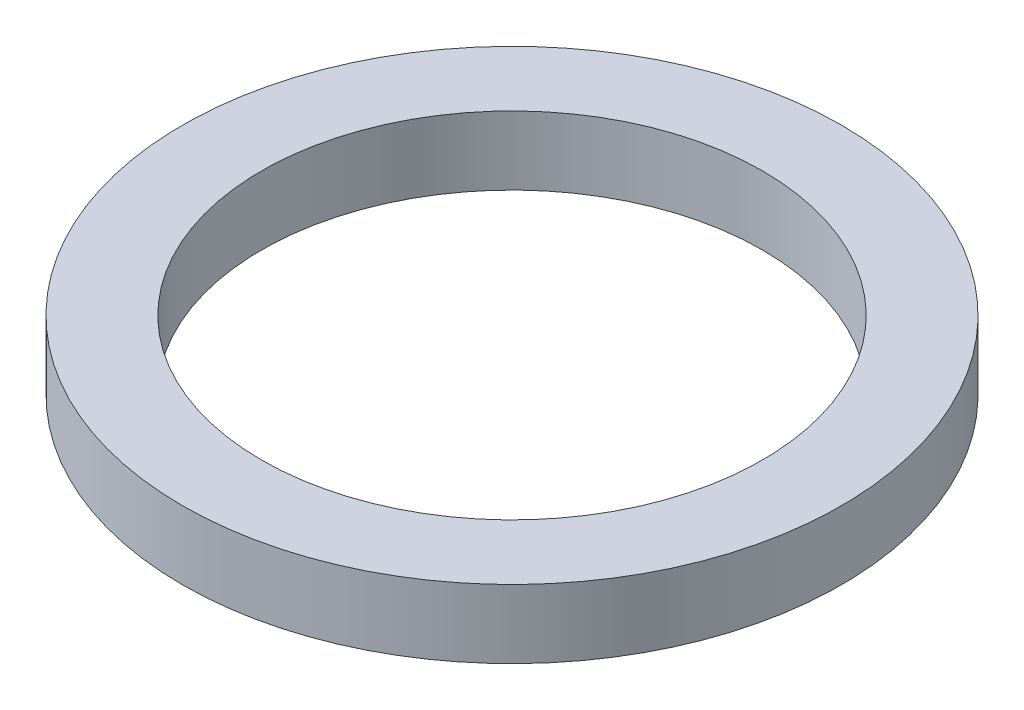
ISO-10303-21;
HEADER;
FILE_DESCRIPTION(('STEP AP214'),'2;1');
FILE_NAME('part.step','',(''),(''),'','','');
FILE_SCHEMA(('AUTOMOTIVE_DESIGN { 1 0 10303 214 1 1 1 1 }'));
ENDSEC;
DATA;
#1=APPLICATION_CONTEXT('core data for automotive mechanical design processes');
#2=APPLICATION_PROTOCOL_DEFINITION('international standard','automotive_design',2000,#1);
#3=PRODUCT_CONTEXT('',#1,'mechanical');
#4=PRODUCT('Part','Part','',(#3));
#5=PRODUCT_RELATED_PRODUCT_CATEGORY('part','',(#4));
#6=PRODUCT_DEFINITION_FORMATION('','',#4);
#7=PRODUCT_DEFINITION_CONTEXT('part definition',#1,'design');
#8=PRODUCT_DEFINITION('design','',#6,#7);
#9=PRODUCT_DEFINITION_SHAPE('','',#8);
#10=(LENGTH_UNIT() NAMED_UNIT(*) SI_UNIT(.MILLI.,.METRE.));
#11=(NAMED_UNIT(*) PLANE_ANGLE_UNIT() SI_UNIT($,.RADIAN.));
#12=(NAMED_UNIT(*) SI_UNIT($,.STERADIAN.) SOLID_ANGLE_UNIT());
#13=UNCERTAINTY_MEASURE_WITH_UNIT(LENGTH_MEASURE(1.E-05),#10,'distance_accuracy_value','');
#14=(GEOMETRIC_REPRESENTATION_CONTEXT(3) GLOBAL_UNCERTAINTY_ASSIGNED_CONTEXT((#13)) GLOBAL_UNIT_ASSIGNED_CONTEXT((#10,
#11,#12)) REPRESENTATION_CONTEXT('',''));
#15=CARTESIAN_POINT('',(0.,0.,0.));
#16=DIRECTION('',(0.,0.,1.));
#17=DIRECTION('',(1.,0.,0.));
#18=AXIS2_PLACEMENT_3D('',#15,#16,#17);
#19=CARTESIAN_POINT('',(0.,13.,0.));
#20=DIRECTION('',(0.,-1.,0.));
#21=DIRECTION('',(0.,0.,-1.));
#22=AXIS2_PLACEMENT_3D('',#19,#20,#21);
#23=CYLINDRICAL_SURFACE('',#22,62.5);
#24=CARTESIAN_POINT('',(0.,13.,0.));
#25=DIRECTION('',(0.,1.,0.));
#26=DIRECTION('',(0.,0.,1.));
#27=AXIS2_PLACEMENT_3D('',#24,#25,#26);
#28=CIRCLE('',#27,62.5);
#29=CARTESIAN_POINT('',(0.,13.,-62.5));
#30=VERTEX_POINT('',#29);
#31=EDGE_CURVE('E10',#30,#30,#28,.T.);
#32=CARTESIAN_POINT('',(0.,0.,0.));
#33=DIRECTION('',(0.,1.,0.));
#34=DIRECTION('',(0.,0.,1.));
#35=AXIS2_PLACEMENT_3D('',#32,#33,#34);
#36=CIRCLE('',#35,62.5);
#37=CARTESIAN_POINT('',(0.,0.,-62.5));
#38=VERTEX_POINT('',#37);
#39=EDGE_CURVE('E37',#38,#38,#36,.T.);
#40=CARTESIAN_POINT('',(0.,13.,-62.5));
#41=CARTESIAN_POINT('',(0.,12.8645833333333,-62.5));
#42=CARTESIAN_POINT('',(0.,12.7291666666667,-62.5));
#43=CARTESIAN_POINT('',(0.,12.4583333333333,-62.5));
#44=CARTESIAN_POINT('',(0.,12.3229166666667,-62.5));
#45=CARTESIAN_POINT('',(0.,12.0520833333333,-62.5));
#46=CARTESIAN_POINT('',(0.,11.9166666666667,-62.5));
#47=CARTESIAN_POINT('',(0.,11.6458333333333,-62.5));
#48=CARTESIAN_POINT('',(0.,11.5104166666667,-62.5));
#49=CARTESIAN_POINT('',(0.,11.2395833333333,-62.5));
#50=CARTESIAN_POINT('',(0.,11.1041666666667,-62.5));
#51=CARTESIAN_POINT('',(0.,10.8333333333333,-62.5));
#52=CARTESIAN_POINT('',(0.,10.6979166666667,-62.5));
#53=CARTESIAN_POINT('',(0.,10.4270833333333,-62.5));
#54=CARTESIAN_POINT('',(0.,10.2916666666667,-62.5));
#55=CARTESIAN_POINT('',(0.,10.0208333333333,-62.5));
#56=CARTESIAN_POINT('',(0.,9.88541666666667,-62.5));
#57=CARTESIAN_POINT('',(0.,9.61458333333333,-62.5));
#58=CARTESIAN_POINT('',(0.,9.47916666666667,-62.5));
#59=CARTESIAN_POINT('',(0.,9.20833333333333,-62.5));
#60=CARTESIAN_POINT('',(0.,9.07291666666667,-62.5));
#61=CARTESIAN_POINT('',(0.,8.80208333333333,-62.5));
#62=CARTESIAN_POINT('',(0.,8.66666666666667,-62.5));
#63=CARTESIAN_POINT('',(0.,8.39583333333333,-62.5));
#64=CARTESIAN_POINT('',(0.,8.26041666666667,-62.5));
#65=CARTESIAN_POINT('',(0.,7.98958333333333,-62.5));
#66=CARTESIAN_POINT('',(0.,7.85416666666667,-62.5));
#67=CARTESIAN_POINT('',(0.,7.58333333333333,-62.5));
#68=CARTESIAN_POINT('',(0.,7.44791666666667,-62.5));
#69=CARTESIAN_POINT('',(0.,7.17708333333333,-62.5));
#70=CARTESIAN_POINT('',(0.,7.04166666666667,-62.5));
#71=CARTESIAN_POINT('',(0.,6.77083333333333,-62.5));
#72=CARTESIAN_POINT('',(0.,6.63541666666667,-62.5));
#73=CARTESIAN_POINT('',(0.,6.36458333333333,-62.5));
#74=CARTESIAN_POINT('',(0.,6.22916666666667,-62.5));
#75=CARTESIAN_POINT('',(0.,5.95833333333333,-62.5));
#76=CARTESIAN_POINT('',(0.,5.82291666666667,-62.5));
#77=CARTESIAN_POINT('',(0.,5.55208333333333,-62.5));
#78=CARTESIAN_POINT('',(0.,5.41666666666667,-62.5));
#79=CARTESIAN_POINT('',(0.,5.14583333333333,-62.5));
#80=CARTESIAN_POINT('',(0.,5.01041666666667,-62.5));
#81=CARTESIAN_POINT('',(0.,4.73958333333333,-62.5));
#82=CARTESIAN_POINT('',(0.,4.60416666666667,-62.5));
#83=CARTESIAN_POINT('',(0.,4.33333333333333,-62.5));
#84=CARTESIAN_POINT('',(0.,4.19791666666667,-62.5));
#85=CARTESIAN_POINT('',(0.,3.92708333333333,-62.5));
#86=CARTESIAN_POINT('',(0.,3.79166666666667,-62.5));
#87=CARTESIAN_POINT('',(0.,3.52083333333333,-62.5));
#88=CARTESIAN_POINT('',(0.,3.38541666666667,-62.5));
#89=CARTESIAN_POINT('',(0.,3.11458333333333,-62.5));
#90=CARTESIAN_POINT('',(0.,2.97916666666667,-62.5));
#91=CARTESIAN_POINT('',(0.,2.70833333333333,-62.5));
#92=CARTESIAN_POINT('',(0.,2.57291666666667,-62.5));
#93=CARTESIAN_POINT('',(0.,2.30208333333333,-62.5));
#94=CARTESIAN_POINT('',(0.,2.16666666666667,-62.5));
#95=CARTESIAN_POINT('',(0.,1.89583333333333,-62.5));
#96=CARTESIAN_POINT('',(0.,1.76041666666667,-62.5));
#97=CARTESIAN_POINT('',(0.,1.48958333333333,-62.5));
#98=CARTESIAN_POINT('',(0.,1.35416666666667,-62.5));
#99=CARTESIAN_POINT('',(0.,1.08333333333333,-62.5));
#100=CARTESIAN_POINT('',(0.,0.947916666666667,-62.5));
#101=CARTESIAN_POINT('',(0.,0.677083333333334,-62.5));
#102=CARTESIAN_POINT('',(0.,0.541666666666667,-62.5));
#103=CARTESIAN_POINT('',(0.,0.270833333333334,-62.5));
#104=CARTESIAN_POINT('',(0.,0.135416666666667,-62.5));
#105=CARTESIAN_POINT('',(0.,0.,-62.5));
#106=B_SPLINE_CURVE_WITH_KNOTS('',3,(#40,#41,#42,#43,#44,#45,#46,#47,#48,#49,#50,#51,#52,#53,
#54,#55,#56,#57,#58,#59,#60,#61,#62,#63,#64,#65,#66,#67,#68,#69,#70,#71,#72,#73,#74,#75,#76,#77,
#78,#79,#80,#81,#82,#83,#84,#85,#86,#87,#88,#89,#90,#91,#92,#93,#94,#95,#96,#97,#98,#99,#100,
#101,#102,#103,#104,#105),.UNSPECIFIED.,.F.,.F.,(4,2,2,2,2,2,2,2,2,2,2,2,2,2,2,2,2,2,2,2,2,2,2,
2,2,2,2,2,2,2,2,2,4),(0.,0.406249999999999,0.812499999999999,1.21875,1.625,2.03125,2.4375,
2.84375,3.25,3.65625,4.0625,4.46875,4.875,5.28125,5.6875,6.09375,6.5,6.90625,7.3125,7.71875,
8.125,8.53125,8.9375,9.34375,9.75,10.15625,10.5625,10.96875,11.375,11.78125,12.1875,12.59375,
13.),.UNSPECIFIED.);
#107=EDGE_CURVE('BSEAM40',#30,#38,#106,.T.);
#108=ORIENTED_EDGE('',*,*,#31,.F.);
#109=ORIENTED_EDGE('',*,*,#39,.T.);
#110=ORIENTED_EDGE('',*,*,#107,.T.);
#111=ORIENTED_EDGE('',*,*,#107,.F.);
#112=EDGE_LOOP('',(#108,#110,#109,#111));
#113=FACE_BOUND('',#112,.T.);
#114=ADVANCED_FACE('F40',(#113),#23,.T.);
#115=CARTESIAN_POINT('',(0.,13.,0.));
#116=DIRECTION('',(0.,1.,0.));
#117=DIRECTION('',(0.,0.,1.));
#118=AXIS2_PLACEMENT_3D('',#115,#116,#117);
#119=PLANE('',#118);
#120=CARTESIAN_POINT('',(0.,13.,0.));
#121=DIRECTION('',(0.,1.,0.));
#122=DIRECTION('',(0.,0.,1.));
#123=AXIS2_PLACEMENT_3D('',#120,#121,#122);
#124=CIRCLE('',#123,47.5);
#125=CARTESIAN_POINT('',(0.,13.,-47.5));
#126=VERTEX_POINT('',#125);
#127=EDGE_CURVE('E50',#126,#126,#124,.T.);
#128=ORIENTED_EDGE('',*,*,#127,.F.);
#129=EDGE_LOOP('',(#128));
#130=FACE_BOUND('',#129,.T.);
#131=ORIENTED_EDGE('',*,*,#31,.T.);
#132=EDGE_LOOP('',(#131));
#133=FACE_BOUND('',#132,.T.);
#134=ADVANCED_FACE('F59',(#130,#133),#119,.T.);
#135=CARTESIAN_POINT('',(0.,0.,0.));
#136=DIRECTION('',(0.,1.,0.));
#137=DIRECTION('',(0.,0.,1.));
#138=AXIS2_PLACEMENT_3D('',#135,#136,#137);
#139=PLANE('',#138);
#140=CARTESIAN_POINT('',(0.,0.,0.));
#141=DIRECTION('',(0.,1.,0.));
#142=DIRECTION('',(0.,0.,1.));
#143=AXIS2_PLACEMENT_3D('',#140,#141,#142);
#144=CIRCLE('',#143,47.5);
#145=CARTESIAN_POINT('',(0.,0.,-47.5));
#146=VERTEX_POINT('',#145);
#147=EDGE_CURVE('E47',#146,#146,#144,.T.);
#148=ORIENTED_EDGE('',*,*,#147,.T.);
#149=EDGE_LOOP('',(#148));
#150=FACE_BOUND('',#149,.T.);
#151=ORIENTED_EDGE('',*,*,#39,.F.);
#152=EDGE_LOOP('',(#151));
#153=FACE_BOUND('',#152,.T.);
#154=ADVANCED_FACE('F58',(#150,#153),#139,.F.);
#155=CARTESIAN_POINT('',(0.,13.,0.));
#156=DIRECTION('',(0.,-1.,0.));
#157=DIRECTION('',(0.,0.,-1.));
#158=AXIS2_PLACEMENT_3D('',#155,#156,#157);
#159=CYLINDRICAL_SURFACE('',#158,47.5);
#160=CARTESIAN_POINT('',(0.,13.,-47.5));
#161=CARTESIAN_POINT('',(0.,12.8645833333333,-47.5));
#162=CARTESIAN_POINT('',(0.,12.7291666666667,-47.5));
#163=CARTESIAN_POINT('',(0.,12.4583333333333,-47.5));
#164=CARTESIAN_POINT('',(0.,12.3229166666667,-47.5));
#165=CARTESIAN_POINT('',(0.,12.0520833333333,-47.5));
#166=CARTESIAN_POINT('',(0.,11.9166666666667,-47.5));
#167=CARTESIAN_POINT('',(0.,11.6458333333333,-47.5));
#168=CARTESIAN_POINT('',(0.,11.5104166666667,-47.5));
#169=CARTESIAN_POINT('',(0.,11.2395833333333,-47.5));
#170=CARTESIAN_POINT('',(0.,11.1041666666667,-47.5));
#171=CARTESIAN_POINT('',(0.,10.8333333333333,-47.5));
#172=CARTESIAN_POINT('',(0.,10.6979166666667,-47.5));
#173=CARTESIAN_POINT('',(0.,10.4270833333333,-47.5));
#174=CARTESIAN_POINT('',(0.,10.2916666666667,-47.5));
#175=CARTESIAN_POINT('',(0.,10.0208333333333,-47.5));
#176=CARTESIAN_POINT('',(0.,9.88541666666667,-47.5));
#177=CARTESIAN_POINT('',(0.,9.61458333333333,-47.5));
#178=CARTESIAN_POINT('',(0.,9.47916666666667,-47.5));
#179=CARTESIAN_POINT('',(0.,9.20833333333333,-47.5));
#180=CARTESIAN_POINT('',(0.,9.07291666666666,-47.5));
#181=CARTESIAN_POINT('',(0.,8.80208333333333,-47.5));
#182=CARTESIAN_POINT('',(0.,8.66666666666667,-47.5));
#183=CARTESIAN_POINT('',(0.,8.39583333333333,-47.5));
#184=CARTESIAN_POINT('',(0.,8.26041666666667,-47.5));
#185=CARTESIAN_POINT('',(0.,7.98958333333333,-47.5));
#186=CARTESIAN_POINT('',(0.,7.85416666666667,-47.5));
#187=CARTESIAN_POINT('',(0.,7.58333333333333,-47.5));
#188=CARTESIAN_POINT('',(0.,7.44791666666667,-47.5));
#189=CARTESIAN_POINT('',(0.,7.17708333333333,-47.5));
#190=CARTESIAN_POINT('',(0.,7.04166666666667,-47.5));
#191=CARTESIAN_POINT('',(0.,6.77083333333333,-47.5));
#192=CARTESIAN_POINT('',(0.,6.63541666666667,-47.5));
#193=CARTESIAN_POINT('',(0.,6.36458333333333,-47.5));
#194=CARTESIAN_POINT('',(0.,6.22916666666667,-47.5));
#195=CARTESIAN_POINT('',(0.,5.95833333333333,-47.5));
#196=CARTESIAN_POINT('',(0.,5.82291666666667,-47.5));
#197=CARTESIAN_POINT('',(0.,5.55208333333333,-47.5));
#198=CARTESIAN_POINT('',(0.,5.41666666666667,-47.5));
#199=CARTESIAN_POINT('',(0.,5.14583333333333,-47.5));
#200=CARTESIAN_POINT('',(0.,5.01041666666667,-47.5));
#201=CARTESIAN_POINT('',(0.,4.73958333333333,-47.5));
#202=CARTESIAN_POINT('',(0.,4.60416666666667,-47.5));
#203=CARTESIAN_POINT('',(0.,4.33333333333333,-47.5));
#204=CARTESIAN_POINT('',(0.,4.19791666666667,-47.5));
#205=CARTESIAN_POINT('',(0.,3.92708333333333,-47.5));
#206=CARTESIAN_POINT('',(0.,3.79166666666667,-47.5));
#207=CARTESIAN_POINT('',(0.,3.52083333333333,-47.5));
#208=CARTESIAN_POINT('',(0.,3.38541666666667,-47.5));
#209=CARTESIAN_POINT('',(0.,3.11458333333333,-47.5));
#210=CARTESIAN_POINT('',(0.,2.97916666666667,-47.5));
#211=CARTESIAN_POINT('',(0.,2.70833333333333,-47.5));
#212=CARTESIAN_POINT('',(0.,2.57291666666667,-47.5));
#213=CARTESIAN_POINT('',(0.,2.30208333333333,-47.5));
#214=CARTESIAN_POINT('',(0.,2.16666666666667,-47.5));
#215=CARTESIAN_POINT('',(0.,1.89583333333333,-47.5));
#216=CARTESIAN_POINT('',(0.,1.76041666666667,-47.5));
#217=CARTESIAN_POINT('',(0.,1.48958333333333,-47.5));
#218=CARTESIAN_POINT('',(0.,1.35416666666667,-47.5));
#219=CARTESIAN_POINT('',(0.,1.08333333333333,-47.5));
#220=CARTESIAN_POINT('',(0.,0.947916666666667,-47.5));
#221=CARTESIAN_POINT('',(0.,0.677083333333334,-47.5));
#222=CARTESIAN_POINT('',(0.,0.541666666666667,-47.5));
#223=CARTESIAN_POINT('',(0.,0.270833333333334,-47.5));
#224=CARTESIAN_POINT('',(0.,0.135416666666667,-47.5));
#225=CARTESIAN_POINT('',(0.,0.,-47.5));
#226=B_SPLINE_CURVE_WITH_KNOTS('',3,(#160,#161,#162,#163,#164,#165,#166,#167,#168,#169,#170,
#171,#172,#173,#174,#175,#176,#177,#178,#179,#180,#181,#182,#183,#184,#185,#186,#187,#188,#189,
#190,#191,#192,#193,#194,#195,#196,#197,#198,#199,#200,#201,#202,#203,#204,#205,#206,#207,#208,
#209,#210,#211,#212,#213,#214,#215,#216,#217,#218,#219,#220,#221,#222,#223,#224,#225),
.UNSPECIFIED.,.F.,.F.,(4,2,2,2,2,2,2,2,2,2,2,2,2,2,2,2,2,2,2,2,2,2,2,2,2,2,2,2,2,2,2,2,4),(0.,
0.40625,0.812500000000001,1.21875,1.625,2.03125,2.4375,2.84375,3.25,3.65625,4.0625,4.46875,
4.875,5.28125,5.6875,6.09375,6.5,6.90625,7.3125,7.71875,8.125,8.53125,8.9375,9.34375,9.75,
10.15625,10.5625,10.96875,11.375,11.78125,12.1875,12.59375,13.),.UNSPECIFIED.);
#227=EDGE_CURVE('BSEAM54',#126,#146,#226,.T.);
#228=ORIENTED_EDGE('',*,*,#127,.T.);
#229=ORIENTED_EDGE('',*,*,#147,.F.);
#230=ORIENTED_EDGE('',*,*,#227,.T.);
#231=ORIENTED_EDGE('',*,*,#227,.F.);
#232=EDGE_LOOP('',(#228,#230,#229,#231));
#233=FACE_BOUND('',#232,.T.);
#234=ADVANCED_FACE('F54',(#233),#159,.F.);
#235=CLOSED_SHELL('',(#114,#134,#154,#234));
#236=MANIFOLD_SOLID_BREP('B2',#235);
#237=ADVANCED_BREP_SHAPE_REPRESENTATION('',(#18,#236),#14);
#238=SHAPE_DEFINITION_REPRESENTATION(#9,#237);
ENDSEC;
END-ISO-10303-21;
